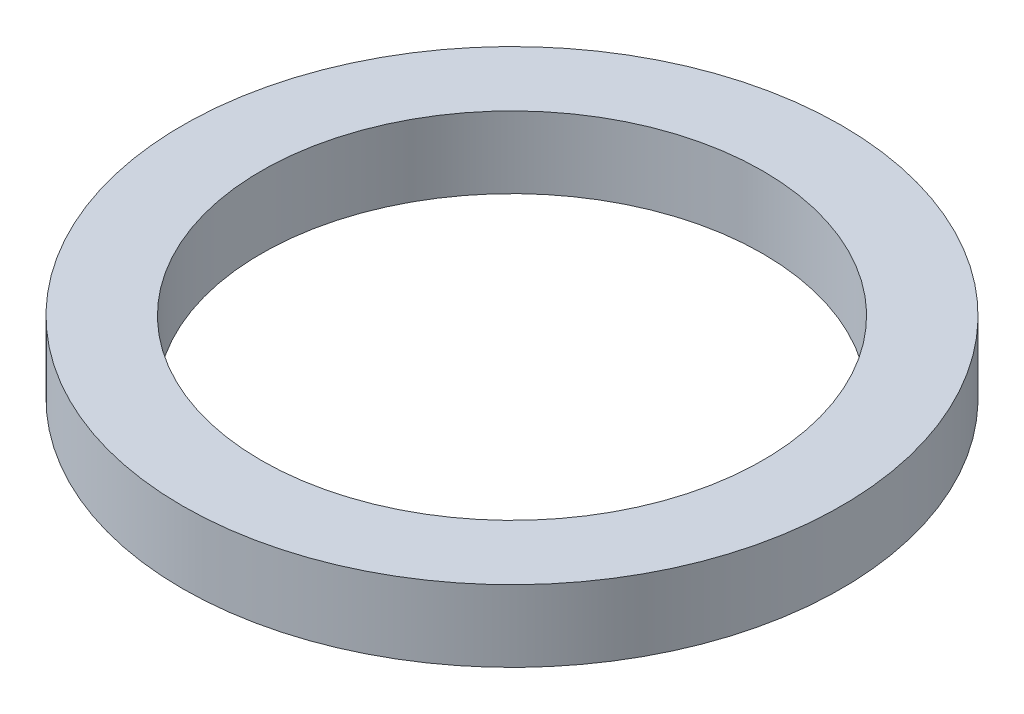
ISO-10303-21;
HEADER;
FILE_DESCRIPTION(('STEP AP214'),'2;1');
FILE_NAME('part.step','',(''),(''),'','','');
FILE_SCHEMA(('AUTOMOTIVE_DESIGN { 1 0 10303 214 1 1 1 1 }'));
ENDSEC;
DATA;
#1=APPLICATION_CONTEXT('core data for automotive mechanical design processes');
#2=APPLICATION_PROTOCOL_DEFINITION('international standard','automotive_design',2000,#1);
#3=PRODUCT_CONTEXT('',#1,'mechanical');
#4=PRODUCT('Part','Part','',(#3));
#5=PRODUCT_RELATED_PRODUCT_CATEGORY('part','',(#4));
#6=PRODUCT_DEFINITION_FORMATION('','',#4);
#7=PRODUCT_DEFINITION_CONTEXT('part definition',#1,'design');
#8=PRODUCT_DEFINITION('design','',#6,#7);
#9=PRODUCT_DEFINITION_SHAPE('','',#8);
#10=(LENGTH_UNIT() NAMED_UNIT(*) SI_UNIT(.MILLI.,.METRE.));
#11=(NAMED_UNIT(*) PLANE_ANGLE_UNIT() SI_UNIT($,.RADIAN.));
#12=(NAMED_UNIT(*) SI_UNIT($,.STERADIAN.) SOLID_ANGLE_UNIT());
#13=UNCERTAINTY_MEASURE_WITH_UNIT(LENGTH_MEASURE(1.E-05),#10,'distance_accuracy_value','');
#14=(GEOMETRIC_REPRESENTATION_CONTEXT(3) GLOBAL_UNCERTAINTY_ASSIGNED_CONTEXT((#13)) GLOBAL_UNIT_ASSIGNED_CONTEXT((#10,
#11,#12)) REPRESENTATION_CONTEXT('',''));
#15=CARTESIAN_POINT('',(0.,0.,0.));
#16=DIRECTION('',(0.,0.,1.));
#17=DIRECTION('',(1.,0.,0.));
#18=AXIS2_PLACEMENT_3D('',#15,#16,#17);
#19=CARTESIAN_POINT('',(0.,0.5,0.));
#20=DIRECTION('',(0.,-1.,0.));
#21=DIRECTION('',(0.,0.,-1.));
#22=AXIS2_PLACEMENT_3D('',#19,#20,#21);
#23=CYLINDRICAL_SURFACE('',#22,2.3);
#24=CARTESIAN_POINT('',(0.,0.5,0.));
#25=DIRECTION('',(0.,1.,0.));
#26=DIRECTION('',(0.,0.,1.));
#27=AXIS2_PLACEMENT_3D('',#24,#25,#26);
#28=CIRCLE('',#27,2.3);
#29=CARTESIAN_POINT('',(0.,0.5,2.3));
#30=VERTEX_POINT('',#29);
#31=EDGE_CURVE('E10',#30,#30,#28,.T.);
#32=ORIENTED_EDGE('',*,*,#31,.F.);
#33=EDGE_LOOP('',(#32));
#34=FACE_BOUND('',#33,.T.);
#35=CARTESIAN_POINT('',(0.,0.,0.));
#36=DIRECTION('',(0.,1.,0.));
#37=DIRECTION('',(0.,0.,1.));
#38=AXIS2_PLACEMENT_3D('',#35,#36,#37);
#39=CIRCLE('',#38,2.3);
#40=CARTESIAN_POINT('',(0.,0.,2.3));
#41=VERTEX_POINT('',#40);
#42=EDGE_CURVE('E40',#41,#41,#39,.T.);
#43=ORIENTED_EDGE('',*,*,#42,.T.);
#44=EDGE_LOOP('',(#43));
#45=FACE_BOUND('',#44,.T.);
#46=ADVANCED_FACE('F37',(#34,#45),#23,.T.);
#47=CARTESIAN_POINT('',(0.,0.5,0.));
#48=DIRECTION('',(0.,1.,0.));
#49=DIRECTION('',(0.,0.,1.));
#50=AXIS2_PLACEMENT_3D('',#47,#48,#49);
#51=PLANE('',#50);
#52=CARTESIAN_POINT('',(0.,0.5,0.));
#53=DIRECTION('',(0.,1.,0.));
#54=DIRECTION('',(0.,0.,1.));
#55=AXIS2_PLACEMENT_3D('',#52,#53,#54);
#56=CIRCLE('',#55,1.75);
#57=CARTESIAN_POINT('',(0.,0.5,1.75));
#58=VERTEX_POINT('',#57);
#59=EDGE_CURVE('E51',#58,#58,#56,.T.);
#60=ORIENTED_EDGE('',*,*,#59,.F.);
#61=EDGE_LOOP('',(#60));
#62=FACE_BOUND('',#61,.T.);
#63=ORIENTED_EDGE('',*,*,#31,.T.);
#64=EDGE_LOOP('',(#63));
#65=FACE_BOUND('',#64,.T.);
#66=ADVANCED_FACE('F68',(#62,#65),#51,.T.);
#67=CARTESIAN_POINT('',(0.,0.,0.));
#68=DIRECTION('',(0.,1.,0.));
#69=DIRECTION('',(0.,0.,1.));
#70=AXIS2_PLACEMENT_3D('',#67,#68,#69);
#71=PLANE('',#70);
#72=CARTESIAN_POINT('',(0.,0.,0.));
#73=DIRECTION('',(0.,1.,0.));
#74=DIRECTION('',(0.,0.,1.));
#75=AXIS2_PLACEMENT_3D('',#72,#73,#74);
#76=CIRCLE('',#75,1.75);
#77=CARTESIAN_POINT('',(0.,0.,1.75));
#78=VERTEX_POINT('',#77);
#79=EDGE_CURVE('E49',#78,#78,#76,.T.);
#80=ORIENTED_EDGE('',*,*,#79,.T.);
#81=EDGE_LOOP('',(#80));
#82=FACE_BOUND('',#81,.T.);
#83=ORIENTED_EDGE('',*,*,#42,.F.);
#84=EDGE_LOOP('',(#83));
#85=FACE_BOUND('',#84,.T.);
#86=ADVANCED_FACE('F59',(#82,#85),#71,.F.);
#87=CARTESIAN_POINT('',(0.,0.,0.));
#88=DIRECTION('',(0.,1.,0.));
#89=DIRECTION('',(0.,0.,1.));
#90=AXIS2_PLACEMENT_3D('',#87,#88,#89);
#91=CYLINDRICAL_SURFACE('',#90,1.75);
#92=ORIENTED_EDGE('',*,*,#79,.F.);
#93=EDGE_LOOP('',(#92));
#94=FACE_BOUND('',#93,.T.);
#95=ORIENTED_EDGE('',*,*,#59,.T.);
#96=EDGE_LOOP('',(#95));
#97=FACE_BOUND('',#96,.T.);
#98=ADVANCED_FACE('F62',(#94,#97),#91,.F.);
#99=CLOSED_SHELL('',(#46,#66,#86,#98));
#100=MANIFOLD_SOLID_BREP('B2',#99);
#101=ADVANCED_BREP_SHAPE_REPRESENTATION('',(#18,#100),#14);
#102=SHAPE_DEFINITION_REPRESENTATION(#9,#101);
ENDSEC;
END-ISO-10303-21;
